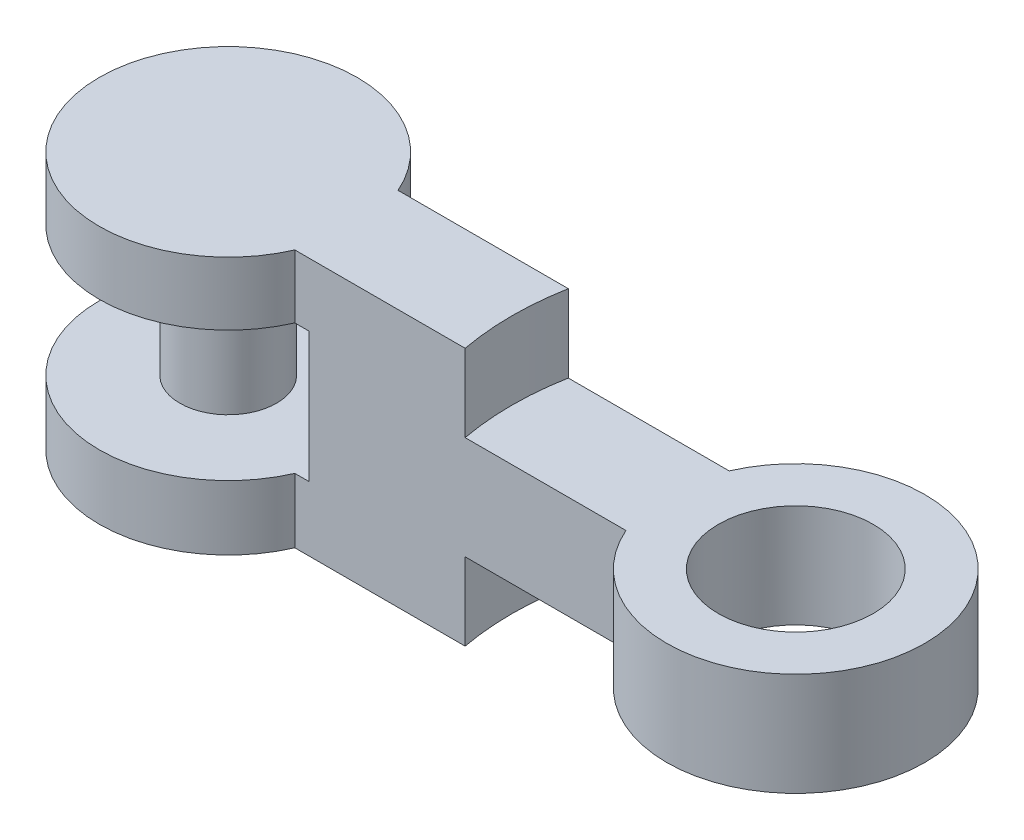
ISO-10303-21;
HEADER;
FILE_DESCRIPTION(('STEP AP214'),'2;1');
FILE_NAME('part.step','',(''),(''),'','','');
FILE_SCHEMA(('AUTOMOTIVE_DESIGN { 1 0 10303 214 1 1 1 1 }'));
ENDSEC;
DATA;
#1=APPLICATION_CONTEXT('core data for automotive mechanical design processes');
#2=APPLICATION_PROTOCOL_DEFINITION('international standard','automotive_design',2000,#1);
#3=PRODUCT_CONTEXT('',#1,'mechanical');
#4=PRODUCT('Part','Part','',(#3));
#5=PRODUCT_RELATED_PRODUCT_CATEGORY('part','',(#4));
#6=PRODUCT_DEFINITION_FORMATION('','',#4);
#7=PRODUCT_DEFINITION_CONTEXT('part definition',#1,'design');
#8=PRODUCT_DEFINITION('design','',#6,#7);
#9=PRODUCT_DEFINITION_SHAPE('','',#8);
#10=(LENGTH_UNIT() NAMED_UNIT(*) SI_UNIT(.MILLI.,.METRE.));
#11=(NAMED_UNIT(*) PLANE_ANGLE_UNIT() SI_UNIT($,.RADIAN.));
#12=(NAMED_UNIT(*) SI_UNIT($,.STERADIAN.) SOLID_ANGLE_UNIT());
#13=UNCERTAINTY_MEASURE_WITH_UNIT(LENGTH_MEASURE(1.E-05),#10,'distance_accuracy_value','');
#14=(GEOMETRIC_REPRESENTATION_CONTEXT(3) GLOBAL_UNCERTAINTY_ASSIGNED_CONTEXT((#13)) GLOBAL_UNIT_ASSIGNED_CONTEXT((#10,
#11,#12)) REPRESENTATION_CONTEXT('',''));
#15=CARTESIAN_POINT('',(0.,0.,0.));
#16=DIRECTION('',(0.,0.,1.));
#17=DIRECTION('',(1.,0.,0.));
#18=AXIS2_PLACEMENT_3D('',#15,#16,#17);
#19=CARTESIAN_POINT('',(0.,5.,2.));
#20=DIRECTION('',(0.,0.,-1.));
#21=DIRECTION('',(-1.,0.,0.));
#22=AXIS2_PLACEMENT_3D('',#19,#20,#21);
#23=PLANE('',#22);
#24=DIRECTION('',(1.,0.,0.));
#25=VECTOR('',#24,1.);
#26=CARTESIAN_POINT('',(0.,-2.5,2.));
#27=LINE('',#26,#25);
#28=CARTESIAN_POINT('',(-6.41742430504416,-2.5,2.));
#29=VERTEX_POINT('',#28);
#30=CARTESIAN_POINT('',(-5.8765246170202,-2.5,2.));
#31=VERTEX_POINT('',#30);
#32=EDGE_CURVE('E143',#29,#31,#27,.T.);
#33=ORIENTED_EDGE('',*,*,#32,.F.);
#34=DIRECTION('',(0.,-1.,0.));
#35=VECTOR('',#34,1.);
#36=CARTESIAN_POINT('',(-6.41742430504416,5.,2.));
#37=LINE('',#36,#35);
#38=CARTESIAN_POINT('',(-6.41742430504416,-5.,2.));
#39=VERTEX_POINT('',#38);
#40=EDGE_CURVE('E225',#29,#39,#37,.T.);
#41=ORIENTED_EDGE('',*,*,#40,.T.);
#42=DIRECTION('',(1.,0.,0.));
#43=VECTOR('',#42,1.);
#44=CARTESIAN_POINT('',(0.,-5.,2.));
#45=LINE('',#44,#43);
#46=CARTESIAN_POINT('',(0.183346173608033,-5.,2.));
#47=VERTEX_POINT('',#46);
#48=EDGE_CURVE('E211',#39,#47,#45,.T.);
#49=ORIENTED_EDGE('',*,*,#48,.T.);
#50=DIRECTION('',(0.,1.,0.));
#51=VECTOR('',#50,1.);
#52=CARTESIAN_POINT('',(0.183346173608033,-5.,2.));
#53=LINE('',#52,#51);
#54=CARTESIAN_POINT('',(0.183346173608033,-2.,2.));
#55=VERTEX_POINT('',#54);
#56=EDGE_CURVE('E66',#47,#55,#53,.T.);
#57=ORIENTED_EDGE('',*,*,#56,.T.);
#58=DIRECTION('',(-1.,0.,0.));
#59=VECTOR('',#58,1.);
#60=CARTESIAN_POINT('',(0.,-2.,2.));
#61=LINE('',#60,#59);
#62=CARTESIAN_POINT('',(6.41742430504416,-2.,2.));
#63=VERTEX_POINT('',#62);
#64=EDGE_CURVE('E177',#63,#55,#61,.T.);
#65=ORIENTED_EDGE('',*,*,#64,.F.);
#66=DIRECTION('',(0.,-1.,0.));
#67=VECTOR('',#66,1.);
#68=CARTESIAN_POINT('',(6.41742430504416,5.,2.));
#69=LINE('',#68,#67);
#70=CARTESIAN_POINT('',(6.41742430504416,2.,2.));
#71=VERTEX_POINT('',#70);
#72=EDGE_CURVE('E222',#71,#63,#69,.T.);
#73=ORIENTED_EDGE('',*,*,#72,.F.);
#74=DIRECTION('',(1.,0.,0.));
#75=VECTOR('',#74,1.);
#76=CARTESIAN_POINT('',(0.,2.,2.));
#77=LINE('',#76,#75);
#78=CARTESIAN_POINT('',(0.183346173608033,2.,2.));
#79=VERTEX_POINT('',#78);
#80=EDGE_CURVE('E195',#79,#71,#77,.T.);
#81=ORIENTED_EDGE('',*,*,#80,.F.);
#82=DIRECTION('',(0.,-1.,0.));
#83=VECTOR('',#82,1.);
#84=CARTESIAN_POINT('',(0.183346173608033,5.,2.));
#85=LINE('',#84,#83);
#86=CARTESIAN_POINT('',(0.183346173608033,5.,2.));
#87=VERTEX_POINT('',#86);
#88=EDGE_CURVE('E187',#87,#79,#85,.T.);
#89=ORIENTED_EDGE('',*,*,#88,.F.);
#90=DIRECTION('',(1.,0.,0.));
#91=VECTOR('',#90,1.);
#92=CARTESIAN_POINT('',(0.,5.,2.));
#93=LINE('',#92,#91);
#94=CARTESIAN_POINT('',(-6.41742430504416,5.,2.));
#95=VERTEX_POINT('',#94);
#96=EDGE_CURVE('E201',#95,#87,#93,.T.);
#97=ORIENTED_EDGE('',*,*,#96,.F.);
#98=CARTESIAN_POINT('',(-6.41742430504416,2.55,2.));
#99=VERTEX_POINT('',#98);
#100=EDGE_CURVE('E51',#95,#99,#37,.T.);
#101=ORIENTED_EDGE('',*,*,#100,.T.);
#102=DIRECTION('',(1.,0.,0.));
#103=VECTOR('',#102,1.);
#104=CARTESIAN_POINT('',(0.,2.55,2.));
#105=LINE('',#104,#103);
#106=CARTESIAN_POINT('',(-5.8765246170202,2.55,2.));
#107=VERTEX_POINT('',#106);
#108=EDGE_CURVE('E58',#99,#107,#105,.T.);
#109=ORIENTED_EDGE('',*,*,#108,.T.);
#110=DIRECTION('',(0.,1.,0.));
#111=VECTOR('',#110,1.);
#112=CARTESIAN_POINT('',(-5.8765246170202,-2.5,2.));
#113=LINE('',#112,#111);
#114=EDGE_CURVE('E134',#107,#31,#113,.F.);
#115=ORIENTED_EDGE('',*,*,#114,.T.);
#116=EDGE_LOOP('',(#33,#41,#49,#57,#65,#73,#81,#89,#97,#101,#109,#115));
#117=FACE_BOUND('',#116,.T.);
#118=ADVANCED_FACE('F43',(#117),#23,.F.);
#119=CARTESIAN_POINT('',(0.,5.,-2.));
#120=DIRECTION('',(0.,0.,-1.));
#121=DIRECTION('',(-1.,0.,0.));
#122=AXIS2_PLACEMENT_3D('',#119,#120,#121);
#123=PLANE('',#122);
#124=DIRECTION('',(0.,-1.,0.));
#125=VECTOR('',#124,1.);
#126=CARTESIAN_POINT('',(-6.41742430504416,5.,-2.));
#127=LINE('',#126,#125);
#128=CARTESIAN_POINT('',(-6.41742430504416,-2.5,-2.));
#129=VERTEX_POINT('',#128);
#130=CARTESIAN_POINT('',(-6.41742430504416,-5.,-2.));
#131=VERTEX_POINT('',#130);
#132=EDGE_CURVE('E208',#129,#131,#127,.T.);
#133=ORIENTED_EDGE('',*,*,#132,.F.);
#134=DIRECTION('',(1.,0.,0.));
#135=VECTOR('',#134,1.);
#136=CARTESIAN_POINT('',(0.,-2.5,-2.));
#137=LINE('',#136,#135);
#138=CARTESIAN_POINT('',(-5.8765246170202,-2.5,-2.));
#139=VERTEX_POINT('',#138);
#140=EDGE_CURVE('E161',#129,#139,#137,.T.);
#141=ORIENTED_EDGE('',*,*,#140,.T.);
#142=DIRECTION('',(0.,1.,0.));
#143=VECTOR('',#142,1.);
#144=CARTESIAN_POINT('',(-5.8765246170202,-2.5,-2.));
#145=LINE('',#144,#143);
#146=CARTESIAN_POINT('',(-5.8765246170202,2.55,-2.));
#147=VERTEX_POINT('',#146);
#148=EDGE_CURVE('E11',#147,#139,#145,.F.);
#149=ORIENTED_EDGE('',*,*,#148,.F.);
#150=DIRECTION('',(1.,0.,0.));
#151=VECTOR('',#150,1.);
#152=CARTESIAN_POINT('',(0.,2.55,-2.));
#153=LINE('',#152,#151);
#154=CARTESIAN_POINT('',(-6.41742430504416,2.55,-2.));
#155=VERTEX_POINT('',#154);
#156=EDGE_CURVE('E147',#155,#147,#153,.T.);
#157=ORIENTED_EDGE('',*,*,#156,.F.);
#158=CARTESIAN_POINT('',(-6.41742430504416,5.,-2.));
#159=VERTEX_POINT('',#158);
#160=EDGE_CURVE('E216',#159,#155,#127,.T.);
#161=ORIENTED_EDGE('',*,*,#160,.F.);
#162=DIRECTION('',(1.,0.,0.));
#163=VECTOR('',#162,1.);
#164=CARTESIAN_POINT('',(0.,5.,-2.));
#165=LINE('',#164,#163);
#166=CARTESIAN_POINT('',(0.183346173608032,5.,-2.));
#167=VERTEX_POINT('',#166);
#168=EDGE_CURVE('E205',#159,#167,#165,.T.);
#169=ORIENTED_EDGE('',*,*,#168,.T.);
#170=DIRECTION('',(0.,-1.,0.));
#171=VECTOR('',#170,1.);
#172=CARTESIAN_POINT('',(0.183346173608032,5.,-2.));
#173=LINE('',#172,#171);
#174=CARTESIAN_POINT('',(0.183346173608032,2.,-2.));
#175=VERTEX_POINT('',#174);
#176=EDGE_CURVE('E182',#167,#175,#173,.T.);
#177=ORIENTED_EDGE('',*,*,#176,.T.);
#178=DIRECTION('',(1.,0.,0.));
#179=VECTOR('',#178,1.);
#180=CARTESIAN_POINT('',(0.,2.,-2.));
#181=LINE('',#180,#179);
#182=CARTESIAN_POINT('',(6.41742430504416,2.,-2.));
#183=VERTEX_POINT('',#182);
#184=EDGE_CURVE('E190',#175,#183,#181,.T.);
#185=ORIENTED_EDGE('',*,*,#184,.T.);
#186=DIRECTION('',(0.,-1.,0.));
#187=VECTOR('',#186,1.);
#188=CARTESIAN_POINT('',(6.41742430504416,5.,-2.));
#189=LINE('',#188,#187);
#190=CARTESIAN_POINT('',(6.41742430504416,-2.,-2.));
#191=VERTEX_POINT('',#190);
#192=EDGE_CURVE('E219',#183,#191,#189,.T.);
#193=ORIENTED_EDGE('',*,*,#192,.T.);
#194=DIRECTION('',(-1.,0.,0.));
#195=VECTOR('',#194,1.);
#196=CARTESIAN_POINT('',(0.,-2.,-2.));
#197=LINE('',#196,#195);
#198=CARTESIAN_POINT('',(0.183346173608032,-2.,-2.));
#199=VERTEX_POINT('',#198);
#200=EDGE_CURVE('E172',#191,#199,#197,.T.);
#201=ORIENTED_EDGE('',*,*,#200,.T.);
#202=DIRECTION('',(0.,1.,0.));
#203=VECTOR('',#202,1.);
#204=CARTESIAN_POINT('',(0.183346173608032,-5.,-2.));
#205=LINE('',#204,#203);
#206=CARTESIAN_POINT('',(0.183346173608032,-5.,-2.));
#207=VERTEX_POINT('',#206);
#208=EDGE_CURVE('E167',#207,#199,#205,.T.);
#209=ORIENTED_EDGE('',*,*,#208,.F.);
#210=DIRECTION('',(1.,0.,0.));
#211=VECTOR('',#210,1.);
#212=CARTESIAN_POINT('',(0.,-5.,-2.));
#213=LINE('',#212,#211);
#214=EDGE_CURVE('E202',#131,#207,#213,.T.);
#215=ORIENTED_EDGE('',*,*,#214,.F.);
#216=EDGE_LOOP('',(#133,#141,#149,#157,#161,#169,#177,#185,#193,#201,#209,#215));
#217=FACE_BOUND('',#216,.T.);
#218=ADVANCED_FACE('F254',(#217),#123,.T.);
#219=CARTESIAN_POINT('',(-11.,5.,0.));
#220=DIRECTION('',(0.,-1.,0.));
#221=DIRECTION('',(0.,0.,-1.));
#222=AXIS2_PLACEMENT_3D('',#219,#220,#221);
#223=CYLINDRICAL_SURFACE('',#222,5.);
#224=CARTESIAN_POINT('',(-11.,-2.5,0.));
#225=DIRECTION('',(0.,1.,0.));
#226=DIRECTION('',(0.,0.,1.));
#227=AXIS2_PLACEMENT_3D('',#224,#225,#226);
#228=CIRCLE('',#227,5.);
#229=EDGE_CURVE('E155',#129,#29,#228,.T.);
#230=ORIENTED_EDGE('',*,*,#229,.F.);
#231=ORIENTED_EDGE('',*,*,#132,.T.);
#232=CARTESIAN_POINT('',(-11.,-5.,0.));
#233=DIRECTION('',(0.,1.,0.));
#234=DIRECTION('',(0.,0.,1.));
#235=AXIS2_PLACEMENT_3D('',#232,#233,#234);
#236=CIRCLE('',#235,5.);
#237=EDGE_CURVE('E197',#131,#39,#236,.T.);
#238=ORIENTED_EDGE('',*,*,#237,.T.);
#239=ORIENTED_EDGE('',*,*,#40,.F.);
#240=EDGE_LOOP('',(#230,#231,#238,#239));
#241=FACE_BOUND('',#240,.T.);
#242=ADVANCED_FACE('F247',(#241),#223,.T.);
#243=CARTESIAN_POINT('',(11.,5.,0.));
#244=DIRECTION('',(0.,-1.,0.));
#245=DIRECTION('',(0.,0.,-1.));
#246=AXIS2_PLACEMENT_3D('',#243,#244,#245);
#247=CYLINDRICAL_SURFACE('',#246,5.);
#248=CARTESIAN_POINT('',(11.,-2.,0.));
#249=DIRECTION('',(0.,-1.,0.));
#250=DIRECTION('',(0.,0.,-1.));
#251=AXIS2_PLACEMENT_3D('',#248,#249,#250);
#252=CIRCLE('',#251,5.);
#253=EDGE_CURVE('E175',#191,#63,#252,.T.);
#254=ORIENTED_EDGE('',*,*,#253,.F.);
#255=ORIENTED_EDGE('',*,*,#192,.F.);
#256=CARTESIAN_POINT('',(11.,2.,0.));
#257=DIRECTION('',(0.,1.,0.));
#258=DIRECTION('',(0.,0.,1.));
#259=AXIS2_PLACEMENT_3D('',#256,#257,#258);
#260=CIRCLE('',#259,5.);
#261=EDGE_CURVE('E193',#71,#183,#260,.T.);
#262=ORIENTED_EDGE('',*,*,#261,.F.);
#263=ORIENTED_EDGE('',*,*,#72,.T.);
#264=EDGE_LOOP('',(#254,#255,#262,#263));
#265=FACE_BOUND('',#264,.T.);
#266=ADVANCED_FACE('F237',(#265),#247,.T.);
#267=CARTESIAN_POINT('',(11.,5.,0.));
#268=DIRECTION('',(0.,-1.,0.));
#269=DIRECTION('',(0.,0.,-1.));
#270=AXIS2_PLACEMENT_3D('',#267,#268,#269);
#271=CYLINDRICAL_SURFACE('',#270,3.);
#272=CARTESIAN_POINT('',(11.,2.,0.));
#273=DIRECTION('',(0.,1.,0.));
#274=DIRECTION('',(0.,0.,1.));
#275=AXIS2_PLACEMENT_3D('',#272,#273,#274);
#276=CIRCLE('',#275,3.);
#277=CARTESIAN_POINT('',(11.,2.,3.));
#278=VERTEX_POINT('',#277);
#279=EDGE_CURVE('E189',#278,#278,#276,.F.);
#280=ORIENTED_EDGE('',*,*,#279,.F.);
#281=EDGE_LOOP('',(#280));
#282=FACE_BOUND('',#281,.T.);
#283=CARTESIAN_POINT('',(11.,-2.,0.));
#284=DIRECTION('',(0.,-1.,0.));
#285=DIRECTION('',(0.,0.,-1.));
#286=AXIS2_PLACEMENT_3D('',#283,#284,#285);
#287=CIRCLE('',#286,3.);
#288=CARTESIAN_POINT('',(11.,-2.,-3.));
#289=VERTEX_POINT('',#288);
#290=EDGE_CURVE('E171',#289,#289,#287,.F.);
#291=ORIENTED_EDGE('',*,*,#290,.F.);
#292=EDGE_LOOP('',(#291));
#293=FACE_BOUND('',#292,.T.);
#294=ADVANCED_FACE('F235',(#282,#293),#271,.F.);
#295=ORIENTED_EDGE('',*,*,#160,.T.);
#296=CARTESIAN_POINT('',(-11.,2.55,0.));
#297=DIRECTION('',(0.,1.,0.));
#298=DIRECTION('',(0.,0.,1.));
#299=AXIS2_PLACEMENT_3D('',#296,#297,#298);
#300=CIRCLE('',#299,5.);
#301=EDGE_CURVE('E156',#155,#99,#300,.T.);
#302=ORIENTED_EDGE('',*,*,#301,.T.);
#303=ORIENTED_EDGE('',*,*,#100,.F.);
#304=CARTESIAN_POINT('',(-11.,5.,0.));
#305=DIRECTION('',(0.,1.,0.));
#306=DIRECTION('',(0.,0.,1.));
#307=AXIS2_PLACEMENT_3D('',#304,#305,#306);
#308=CIRCLE('',#307,5.);
#309=EDGE_CURVE('E198',#159,#95,#308,.T.);
#310=ORIENTED_EDGE('',*,*,#309,.F.);
#311=EDGE_LOOP('',(#295,#302,#303,#310));
#312=FACE_BOUND('',#311,.T.);
#313=ADVANCED_FACE('F45',(#312),#223,.T.);
#314=CARTESIAN_POINT('',(0.,5.,0.));
#315=DIRECTION('',(0.,1.,0.));
#316=DIRECTION('',(0.,0.,1.));
#317=AXIS2_PLACEMENT_3D('',#314,#315,#316);
#318=PLANE('',#317);
#319=ORIENTED_EDGE('',*,*,#96,.T.);
#320=CARTESIAN_POINT('',(11.,5.,0.));
#321=DIRECTION('',(0.,1.,0.));
#322=DIRECTION('',(0.,0.,1.));
#323=AXIS2_PLACEMENT_3D('',#320,#321,#322);
#324=CIRCLE('',#323,11.);
#325=EDGE_CURVE('E180',#167,#87,#324,.T.);
#326=ORIENTED_EDGE('',*,*,#325,.F.);
#327=ORIENTED_EDGE('',*,*,#168,.F.);
#328=ORIENTED_EDGE('',*,*,#309,.T.);
#329=EDGE_LOOP('',(#319,#326,#327,#328));
#330=FACE_BOUND('',#329,.T.);
#331=ADVANCED_FACE('F245',(#330),#318,.T.);
#332=CARTESIAN_POINT('',(0.,-5.,0.));
#333=DIRECTION('',(0.,1.,0.));
#334=DIRECTION('',(0.,0.,1.));
#335=AXIS2_PLACEMENT_3D('',#332,#333,#334);
#336=PLANE('',#335);
#337=ORIENTED_EDGE('',*,*,#214,.T.);
#338=CARTESIAN_POINT('',(11.,-5.,0.));
#339=DIRECTION('',(0.,1.,0.));
#340=DIRECTION('',(0.,0.,1.));
#341=AXIS2_PLACEMENT_3D('',#338,#339,#340);
#342=CIRCLE('',#341,11.);
#343=EDGE_CURVE('E165',#207,#47,#342,.T.);
#344=ORIENTED_EDGE('',*,*,#343,.T.);
#345=ORIENTED_EDGE('',*,*,#48,.F.);
#346=ORIENTED_EDGE('',*,*,#237,.F.);
#347=EDGE_LOOP('',(#337,#344,#345,#346));
#348=FACE_BOUND('',#347,.T.);
#349=ADVANCED_FACE('F272',(#348),#336,.F.);
#350=CARTESIAN_POINT('',(11.,2.,0.));
#351=DIRECTION('',(0.,1.,0.));
#352=DIRECTION('',(0.,0.,1.));
#353=AXIS2_PLACEMENT_3D('',#350,#351,#352);
#354=PLANE('',#353);
#355=ORIENTED_EDGE('',*,*,#279,.T.);
#356=EDGE_LOOP('',(#355));
#357=FACE_BOUND('',#356,.T.);
#358=ORIENTED_EDGE('',*,*,#80,.T.);
#359=ORIENTED_EDGE('',*,*,#261,.T.);
#360=ORIENTED_EDGE('',*,*,#184,.F.);
#361=CARTESIAN_POINT('',(11.,2.,0.));
#362=DIRECTION('',(0.,1.,0.));
#363=DIRECTION('',(0.,0.,1.));
#364=AXIS2_PLACEMENT_3D('',#361,#362,#363);
#365=CIRCLE('',#364,11.);
#366=EDGE_CURVE('E179',#175,#79,#365,.T.);
#367=ORIENTED_EDGE('',*,*,#366,.T.);
#368=EDGE_LOOP('',(#358,#359,#360,#367));
#369=FACE_BOUND('',#368,.T.);
#370=ADVANCED_FACE('F301',(#357,#369),#354,.T.);
#371=CARTESIAN_POINT('',(11.,5.,0.));
#372=DIRECTION('',(0.,-1.,0.));
#373=DIRECTION('',(0.,0.,-1.));
#374=AXIS2_PLACEMENT_3D('',#371,#372,#373);
#375=CYLINDRICAL_SURFACE('',#374,11.);
#376=ORIENTED_EDGE('',*,*,#88,.T.);
#377=ORIENTED_EDGE('',*,*,#366,.F.);
#378=ORIENTED_EDGE('',*,*,#176,.F.);
#379=ORIENTED_EDGE('',*,*,#325,.T.);
#380=EDGE_LOOP('',(#376,#377,#378,#379));
#381=FACE_BOUND('',#380,.T.);
#382=ADVANCED_FACE('F299',(#381),#375,.F.);
#383=CARTESIAN_POINT('',(11.,-2.,0.));
#384=DIRECTION('',(0.,-1.,0.));
#385=DIRECTION('',(0.,0.,1.));
#386=AXIS2_PLACEMENT_3D('',#383,#384,#385);
#387=PLANE('',#386);
#388=ORIENTED_EDGE('',*,*,#290,.T.);
#389=EDGE_LOOP('',(#388));
#390=FACE_BOUND('',#389,.T.);
#391=ORIENTED_EDGE('',*,*,#64,.T.);
#392=CARTESIAN_POINT('',(11.,-2.,0.));
#393=DIRECTION('',(0.,1.,0.));
#394=DIRECTION('',(0.,0.,1.));
#395=AXIS2_PLACEMENT_3D('',#392,#393,#394);
#396=CIRCLE('',#395,11.);
#397=EDGE_CURVE('E142',#199,#55,#396,.T.);
#398=ORIENTED_EDGE('',*,*,#397,.F.);
#399=ORIENTED_EDGE('',*,*,#200,.F.);
#400=ORIENTED_EDGE('',*,*,#253,.T.);
#401=EDGE_LOOP('',(#391,#398,#399,#400));
#402=FACE_BOUND('',#401,.T.);
#403=ADVANCED_FACE('F232',(#390,#402),#387,.T.);
#404=CARTESIAN_POINT('',(11.,-5.,0.));
#405=DIRECTION('',(0.,1.,0.));
#406=DIRECTION('',(0.,0.,1.));
#407=AXIS2_PLACEMENT_3D('',#404,#405,#406);
#408=CYLINDRICAL_SURFACE('',#407,11.);
#409=ORIENTED_EDGE('',*,*,#343,.F.);
#410=ORIENTED_EDGE('',*,*,#208,.T.);
#411=ORIENTED_EDGE('',*,*,#397,.T.);
#412=ORIENTED_EDGE('',*,*,#56,.F.);
#413=EDGE_LOOP('',(#409,#410,#411,#412));
#414=FACE_BOUND('',#413,.T.);
#415=ADVANCED_FACE('F297',(#414),#408,.F.);
#416=CARTESIAN_POINT('',(-11.,-2.5,0.));
#417=DIRECTION('',(0.,1.,0.));
#418=DIRECTION('',(0.,0.,1.));
#419=AXIS2_PLACEMENT_3D('',#416,#417,#418);
#420=CYLINDRICAL_SURFACE('',#419,5.5);
#421=CARTESIAN_POINT('',(-11.,2.55,0.));
#422=DIRECTION('',(0.,1.,0.));
#423=DIRECTION('',(0.,0.,1.));
#424=AXIS2_PLACEMENT_3D('',#421,#422,#423);
#425=CIRCLE('',#424,5.5);
#426=EDGE_CURVE('E136',#107,#147,#425,.T.);
#427=ORIENTED_EDGE('',*,*,#426,.T.);
#428=ORIENTED_EDGE('',*,*,#148,.T.);
#429=CARTESIAN_POINT('',(-11.,-2.5,0.));
#430=DIRECTION('',(0.,1.,0.));
#431=DIRECTION('',(0.,0.,1.));
#432=AXIS2_PLACEMENT_3D('',#429,#430,#431);
#433=CIRCLE('',#432,5.5);
#434=EDGE_CURVE('E139',#31,#139,#433,.T.);
#435=ORIENTED_EDGE('',*,*,#434,.F.);
#436=ORIENTED_EDGE('',*,*,#114,.F.);
#437=EDGE_LOOP('',(#427,#428,#435,#436));
#438=FACE_BOUND('',#437,.T.);
#439=ADVANCED_FACE('F135',(#438),#420,.F.);
#440=CARTESIAN_POINT('',(0.,-2.5,0.));
#441=DIRECTION('',(0.,1.,0.));
#442=DIRECTION('',(0.,0.,1.));
#443=AXIS2_PLACEMENT_3D('',#440,#441,#442);
#444=PLANE('',#443);
#445=CARTESIAN_POINT('',(-11.,-2.5,0.));
#446=DIRECTION('',(0.,1.,0.));
#447=DIRECTION('',(0.,0.,1.));
#448=AXIS2_PLACEMENT_3D('',#445,#446,#447);
#449=CIRCLE('',#448,1.875);
#450=CARTESIAN_POINT('',(-11.,-2.5,1.875));
#451=VERTEX_POINT('',#450);
#452=EDGE_CURVE('E152',#451,#451,#449,.T.);
#453=ORIENTED_EDGE('',*,*,#452,.F.);
#454=EDGE_LOOP('',(#453));
#455=FACE_BOUND('',#454,.T.);
#456=ORIENTED_EDGE('',*,*,#32,.T.);
#457=ORIENTED_EDGE('',*,*,#434,.T.);
#458=ORIENTED_EDGE('',*,*,#140,.F.);
#459=ORIENTED_EDGE('',*,*,#229,.T.);
#460=EDGE_LOOP('',(#456,#457,#458,#459));
#461=FACE_BOUND('',#460,.T.);
#462=ADVANCED_FACE('F275',(#455,#461),#444,.T.);
#463=CARTESIAN_POINT('',(0.,2.55,0.));
#464=DIRECTION('',(0.,1.,0.));
#465=DIRECTION('',(0.,0.,1.));
#466=AXIS2_PLACEMENT_3D('',#463,#464,#465);
#467=PLANE('',#466);
#468=CARTESIAN_POINT('',(-11.,2.55,0.));
#469=DIRECTION('',(0.,1.,0.));
#470=DIRECTION('',(0.,0.,1.));
#471=AXIS2_PLACEMENT_3D('',#468,#469,#470);
#472=CIRCLE('',#471,1.875);
#473=CARTESIAN_POINT('',(-11.,2.55,1.875));
#474=VERTEX_POINT('',#473);
#475=EDGE_CURVE('E148',#474,#474,#472,.T.);
#476=ORIENTED_EDGE('',*,*,#475,.T.);
#477=EDGE_LOOP('',(#476));
#478=FACE_BOUND('',#477,.T.);
#479=ORIENTED_EDGE('',*,*,#301,.F.);
#480=ORIENTED_EDGE('',*,*,#156,.T.);
#481=ORIENTED_EDGE('',*,*,#426,.F.);
#482=ORIENTED_EDGE('',*,*,#108,.F.);
#483=EDGE_LOOP('',(#479,#480,#481,#482));
#484=FACE_BOUND('',#483,.T.);
#485=ADVANCED_FACE('F145',(#478,#484),#467,.F.);
#486=CARTESIAN_POINT('',(-11.,-10.3033008588991,0.));
#487=DIRECTION('',(0.,1.,0.));
#488=DIRECTION('',(0.,0.,1.));
#489=AXIS2_PLACEMENT_3D('',#486,#487,#488);
#490=CYLINDRICAL_SURFACE('',#489,1.875);
#491=ORIENTED_EDGE('',*,*,#452,.T.);
#492=EDGE_LOOP('',(#491));
#493=FACE_BOUND('',#492,.T.);
#494=ORIENTED_EDGE('',*,*,#475,.F.);
#495=EDGE_LOOP('',(#494));
#496=FACE_BOUND('',#495,.T.);
#497=ADVANCED_FACE('F282',(#493,#496),#490,.T.);
#498=CLOSED_SHELL('',(#118,#218,#242,#266,#294,#313,#331,#349,#370,#382,#403,#415,#439,#462,
#485,#497));
#499=MANIFOLD_SOLID_BREP('B2',#498);
#500=ADVANCED_BREP_SHAPE_REPRESENTATION('',(#18,#499),#14);
#501=SHAPE_DEFINITION_REPRESENTATION(#9,#500);
ENDSEC;
END-ISO-10303-21;
